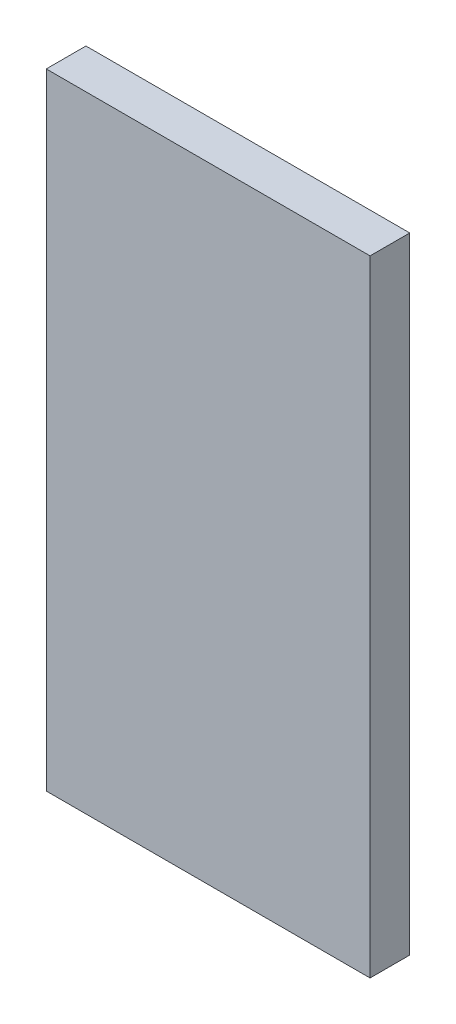
ISO-10303-21;
HEADER;
FILE_DESCRIPTION(('STEP AP214'),'2;1');
FILE_NAME('part.step','',(''),(''),'','','');
FILE_SCHEMA(('AUTOMOTIVE_DESIGN { 1 0 10303 214 1 1 1 1 }'));
ENDSEC;
DATA;
#1=APPLICATION_CONTEXT('core data for automotive mechanical design processes');
#2=APPLICATION_PROTOCOL_DEFINITION('international standard','automotive_design',2000,#1);
#3=PRODUCT_CONTEXT('',#1,'mechanical');
#4=PRODUCT('Part','Part','',(#3));
#5=PRODUCT_RELATED_PRODUCT_CATEGORY('part','',(#4));
#6=PRODUCT_DEFINITION_FORMATION('','',#4);
#7=PRODUCT_DEFINITION_CONTEXT('part definition',#1,'design');
#8=PRODUCT_DEFINITION('design','',#6,#7);
#9=PRODUCT_DEFINITION_SHAPE('','',#8);
#10=(LENGTH_UNIT() NAMED_UNIT(*) SI_UNIT(.MILLI.,.METRE.));
#11=(NAMED_UNIT(*) PLANE_ANGLE_UNIT() SI_UNIT($,.RADIAN.));
#12=(NAMED_UNIT(*) SI_UNIT($,.STERADIAN.) SOLID_ANGLE_UNIT());
#13=UNCERTAINTY_MEASURE_WITH_UNIT(LENGTH_MEASURE(1.E-05),#10,'distance_accuracy_value','');
#14=(GEOMETRIC_REPRESENTATION_CONTEXT(3) GLOBAL_UNCERTAINTY_ASSIGNED_CONTEXT((#13)) GLOBAL_UNIT_ASSIGNED_CONTEXT((#10,
#11,#12)) REPRESENTATION_CONTEXT('',''));
#15=CARTESIAN_POINT('',(0.,0.,0.));
#16=DIRECTION('',(0.,0.,1.));
#17=DIRECTION('',(1.,0.,0.));
#18=AXIS2_PLACEMENT_3D('',#15,#16,#17);
#19=CARTESIAN_POINT('',(-2.948,-3.698,0.1));
#20=DIRECTION('',(0.,0.,1.));
#21=DIRECTION('',(1.,0.,0.));
#22=AXIS2_PLACEMENT_3D('',#19,#20,#21);
#23=PLANE('',#22);
#24=DIRECTION('',(0.,1.,0.));
#25=VECTOR('',#24,1.);
#26=CARTESIAN_POINT('',(-2.132,-3.698,0.1));
#27=LINE('',#26,#25);
#28=CARTESIAN_POINT('',(-2.132,-2.122,0.1));
#29=VERTEX_POINT('',#28);
#30=CARTESIAN_POINT('',(-2.132,-3.698,0.1));
#31=VERTEX_POINT('',#30);
#32=EDGE_CURVE('E75',#29,#31,#27,.F.);
#33=ORIENTED_EDGE('',*,*,#32,.F.);
#34=DIRECTION('',(1.,0.,0.));
#35=VECTOR('',#34,1.);
#36=CARTESIAN_POINT('',(-2.948,-2.122,0.1));
#37=LINE('',#36,#35);
#38=CARTESIAN_POINT('',(-2.948,-2.122,0.1));
#39=VERTEX_POINT('',#38);
#40=EDGE_CURVE('E57',#39,#29,#37,.T.);
#41=ORIENTED_EDGE('',*,*,#40,.F.);
#42=DIRECTION('',(0.,1.,0.));
#43=VECTOR('',#42,1.);
#44=CARTESIAN_POINT('',(-2.948,-3.698,0.1));
#45=LINE('',#44,#43);
#46=CARTESIAN_POINT('',(-2.948,-3.698,0.1));
#47=VERTEX_POINT('',#46);
#48=EDGE_CURVE('E19',#39,#47,#45,.F.);
#49=ORIENTED_EDGE('',*,*,#48,.T.);
#50=DIRECTION('',(1.,0.,0.));
#51=VECTOR('',#50,1.);
#52=CARTESIAN_POINT('',(-2.948,-3.698,0.1));
#53=LINE('',#52,#51);
#54=EDGE_CURVE('E54',#47,#31,#53,.T.);
#55=ORIENTED_EDGE('',*,*,#54,.T.);
#56=EDGE_LOOP('',(#33,#41,#49,#55));
#57=FACE_BOUND('',#56,.T.);
#58=ADVANCED_FACE('F16',(#57),#23,.T.);
#59=CARTESIAN_POINT('',(-2.948,-3.698,0.));
#60=DIRECTION('',(1.,0.,0.));
#61=DIRECTION('',(0.,0.,-1.));
#62=AXIS2_PLACEMENT_3D('',#59,#60,#61);
#63=PLANE('',#62);
#64=DIRECTION('',(0.,0.,1.));
#65=VECTOR('',#64,1.);
#66=CARTESIAN_POINT('',(-2.948,-2.122,0.));
#67=LINE('',#66,#65);
#68=CARTESIAN_POINT('',(-2.948,-2.122,0.));
#69=VERTEX_POINT('',#68);
#70=EDGE_CURVE('E77',#69,#39,#67,.T.);
#71=ORIENTED_EDGE('',*,*,#70,.F.);
#72=DIRECTION('',(0.,1.,0.));
#73=VECTOR('',#72,1.);
#74=CARTESIAN_POINT('',(-2.948,-3.698,0.));
#75=LINE('',#74,#73);
#76=CARTESIAN_POINT('',(-2.948,-3.698,0.));
#77=VERTEX_POINT('',#76);
#78=EDGE_CURVE('E72',#69,#77,#75,.F.);
#79=ORIENTED_EDGE('',*,*,#78,.T.);
#80=DIRECTION('',(0.,0.,1.));
#81=VECTOR('',#80,1.);
#82=CARTESIAN_POINT('',(-2.948,-3.698,0.));
#83=LINE('',#82,#81);
#84=EDGE_CURVE('E62',#77,#47,#83,.T.);
#85=ORIENTED_EDGE('',*,*,#84,.T.);
#86=ORIENTED_EDGE('',*,*,#48,.F.);
#87=EDGE_LOOP('',(#71,#79,#85,#86));
#88=FACE_BOUND('',#87,.T.);
#89=ADVANCED_FACE('F71',(#88),#63,.F.);
#90=CARTESIAN_POINT('',(-2.948,-3.698,0.));
#91=DIRECTION('',(0.,1.,0.));
#92=DIRECTION('',(0.,0.,1.));
#93=AXIS2_PLACEMENT_3D('',#90,#91,#92);
#94=PLANE('',#93);
#95=ORIENTED_EDGE('',*,*,#54,.F.);
#96=ORIENTED_EDGE('',*,*,#84,.F.);
#97=DIRECTION('',(1.,0.,0.));
#98=VECTOR('',#97,1.);
#99=CARTESIAN_POINT('',(-2.948,-3.698,0.));
#100=LINE('',#99,#98);
#101=CARTESIAN_POINT('',(-2.132,-3.698,0.));
#102=VERTEX_POINT('',#101);
#103=EDGE_CURVE('E82',#77,#102,#100,.T.);
#104=ORIENTED_EDGE('',*,*,#103,.T.);
#105=DIRECTION('',(0.,0.,-1.));
#106=VECTOR('',#105,1.);
#107=CARTESIAN_POINT('',(-2.132,-3.698,0.));
#108=LINE('',#107,#106);
#109=EDGE_CURVE('E68',#31,#102,#108,.T.);
#110=ORIENTED_EDGE('',*,*,#109,.F.);
#111=EDGE_LOOP('',(#95,#96,#104,#110));
#112=FACE_BOUND('',#111,.T.);
#113=ADVANCED_FACE('F65',(#112),#94,.F.);
#114=CARTESIAN_POINT('',(-2.132,-3.698,0.));
#115=DIRECTION('',(1.,0.,0.));
#116=DIRECTION('',(0.,0.,-1.));
#117=AXIS2_PLACEMENT_3D('',#114,#115,#116);
#118=PLANE('',#117);
#119=DIRECTION('',(0.,0.,1.));
#120=VECTOR('',#119,1.);
#121=CARTESIAN_POINT('',(-2.132,-2.122,0.));
#122=LINE('',#121,#120);
#123=CARTESIAN_POINT('',(-2.132,-2.122,0.));
#124=VERTEX_POINT('',#123);
#125=EDGE_CURVE('E33',#29,#124,#122,.F.);
#126=ORIENTED_EDGE('',*,*,#125,.F.);
#127=ORIENTED_EDGE('',*,*,#32,.T.);
#128=ORIENTED_EDGE('',*,*,#109,.T.);
#129=DIRECTION('',(0.,1.,0.));
#130=VECTOR('',#129,1.);
#131=CARTESIAN_POINT('',(-2.132,-3.698,0.));
#132=LINE('',#131,#130);
#133=EDGE_CURVE('E25',#102,#124,#132,.T.);
#134=ORIENTED_EDGE('',*,*,#133,.T.);
#135=EDGE_LOOP('',(#126,#127,#128,#134));
#136=FACE_BOUND('',#135,.T.);
#137=ADVANCED_FACE('F87',(#136),#118,.T.);
#138=CARTESIAN_POINT('',(-2.948,-2.122,0.));
#139=DIRECTION('',(0.,1.,0.));
#140=DIRECTION('',(0.,0.,1.));
#141=AXIS2_PLACEMENT_3D('',#138,#139,#140);
#142=PLANE('',#141);
#143=ORIENTED_EDGE('',*,*,#40,.T.);
#144=ORIENTED_EDGE('',*,*,#125,.T.);
#145=DIRECTION('',(1.,0.,0.));
#146=VECTOR('',#145,1.);
#147=CARTESIAN_POINT('',(-2.948,-2.122,0.));
#148=LINE('',#147,#146);
#149=EDGE_CURVE('E11',#124,#69,#148,.F.);
#150=ORIENTED_EDGE('',*,*,#149,.T.);
#151=ORIENTED_EDGE('',*,*,#70,.T.);
#152=EDGE_LOOP('',(#143,#144,#150,#151));
#153=FACE_BOUND('',#152,.T.);
#154=ADVANCED_FACE('F90',(#153),#142,.T.);
#155=CARTESIAN_POINT('',(-2.948,-3.698,0.));
#156=DIRECTION('',(0.,0.,1.));
#157=DIRECTION('',(1.,0.,0.));
#158=AXIS2_PLACEMENT_3D('',#155,#156,#157);
#159=PLANE('',#158);
#160=ORIENTED_EDGE('',*,*,#133,.F.);
#161=ORIENTED_EDGE('',*,*,#103,.F.);
#162=ORIENTED_EDGE('',*,*,#78,.F.);
#163=ORIENTED_EDGE('',*,*,#149,.F.);
#164=EDGE_LOOP('',(#160,#161,#162,#163));
#165=FACE_BOUND('',#164,.T.);
#166=ADVANCED_FACE('F89',(#165),#159,.F.);
#167=CLOSED_SHELL('',(#58,#89,#113,#137,#154,#166));
#168=MANIFOLD_SOLID_BREP('B1',#167);
#169=ADVANCED_BREP_SHAPE_REPRESENTATION('',(#18,#168),#14);
#170=SHAPE_DEFINITION_REPRESENTATION(#9,#169);
ENDSEC;
END-ISO-10303-21;
